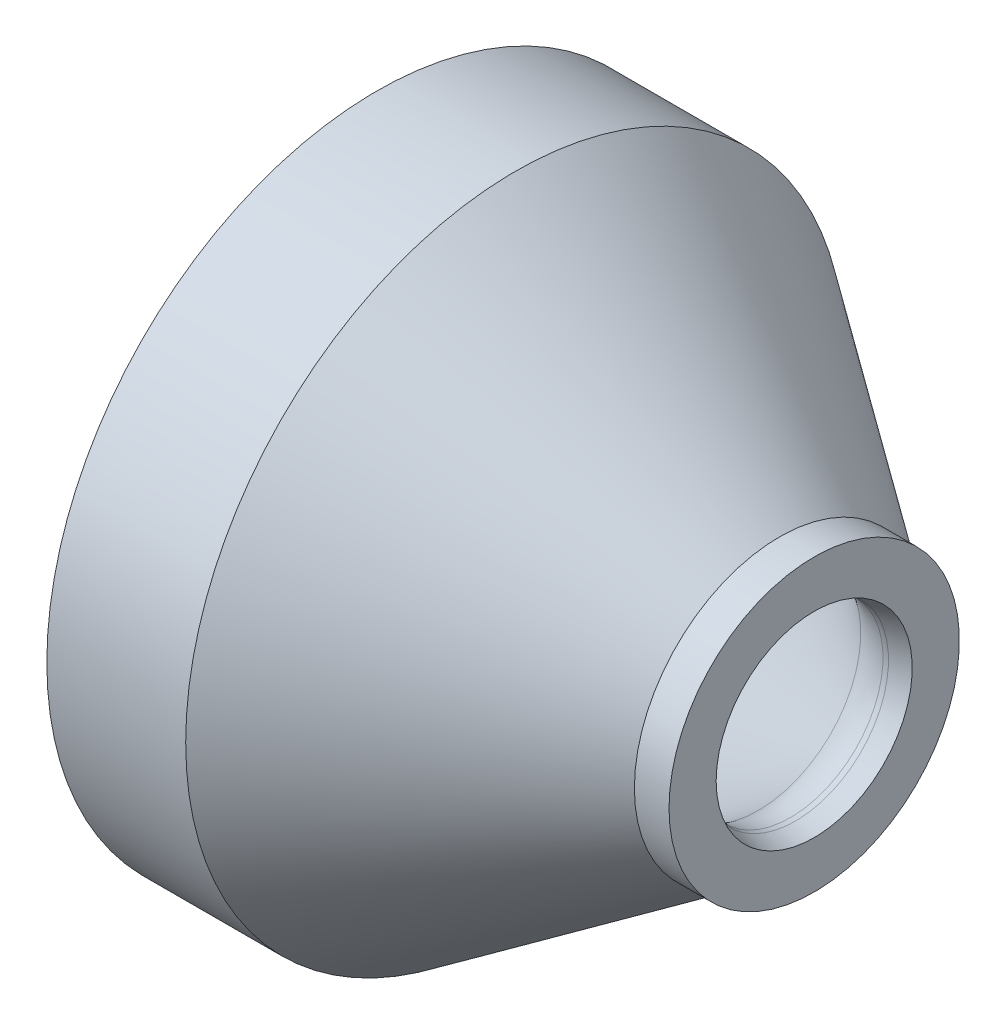
ISO-10303-21;
HEADER;
FILE_DESCRIPTION(('STEP AP214'),'2;1');
FILE_NAME('part.step','',(''),(''),'','','');
FILE_SCHEMA(('AUTOMOTIVE_DESIGN { 1 0 10303 214 1 1 1 1 }'));
ENDSEC;
DATA;
#1=APPLICATION_CONTEXT('core data for automotive mechanical design processes');
#2=APPLICATION_PROTOCOL_DEFINITION('international standard','automotive_design',2000,#1);
#3=PRODUCT_CONTEXT('',#1,'mechanical');
#4=PRODUCT('Part','Part','',(#3));
#5=PRODUCT_RELATED_PRODUCT_CATEGORY('part','',(#4));
#6=PRODUCT_DEFINITION_FORMATION('','',#4);
#7=PRODUCT_DEFINITION_CONTEXT('part definition',#1,'design');
#8=PRODUCT_DEFINITION('design','',#6,#7);
#9=PRODUCT_DEFINITION_SHAPE('','',#8);
#10=(LENGTH_UNIT() NAMED_UNIT(*) SI_UNIT(.MILLI.,.METRE.));
#11=(NAMED_UNIT(*) PLANE_ANGLE_UNIT() SI_UNIT($,.RADIAN.));
#12=(NAMED_UNIT(*) SI_UNIT($,.STERADIAN.) SOLID_ANGLE_UNIT());
#13=UNCERTAINTY_MEASURE_WITH_UNIT(LENGTH_MEASURE(1.E-05),#10,'distance_accuracy_value','');
#14=(GEOMETRIC_REPRESENTATION_CONTEXT(3) GLOBAL_UNCERTAINTY_ASSIGNED_CONTEXT((#13)) GLOBAL_UNIT_ASSIGNED_CONTEXT((#10,
#11,#12)) REPRESENTATION_CONTEXT('',''));
#15=CARTESIAN_POINT('',(0.,0.,0.));
#16=DIRECTION('',(0.,0.,1.));
#17=DIRECTION('',(1.,0.,0.));
#18=AXIS2_PLACEMENT_3D('',#15,#16,#17);
#19=CARTESIAN_POINT('',(54.2559021119693,0.,0.));
#20=DIRECTION('',(-1.,0.,0.));
#21=DIRECTION('',(0.,0.,1.));
#22=AXIS2_PLACEMENT_3D('',#19,#20,#21);
#23=CONICAL_SURFACE('',#22,19.558,0.610865238198016);
#24=CARTESIAN_POINT('',(18.7064419281447,0.,0.));
#25=DIRECTION('',(-1.,0.,0.));
#26=DIRECTION('',(0.,0.,1.));
#27=AXIS2_PLACEMENT_3D('',#24,#25,#26);
#28=CIRCLE('',#27,44.45);
#29=CARTESIAN_POINT('',(18.7064419281447,0.,44.45));
#30=VERTEX_POINT('',#29);
#31=EDGE_CURVE('E10',#30,#30,#28,.T.);
#32=ORIENTED_EDGE('',*,*,#31,.F.);
#33=EDGE_LOOP('',(#32));
#34=FACE_BOUND('',#33,.T.);
#35=CARTESIAN_POINT('',(54.2559021119693,0.,0.));
#36=DIRECTION('',(-1.,0.,0.));
#37=DIRECTION('',(0.,0.,1.));
#38=AXIS2_PLACEMENT_3D('',#35,#36,#37);
#39=CIRCLE('',#38,19.558);
#40=CARTESIAN_POINT('',(54.2559021119693,0.,19.558));
#41=VERTEX_POINT('',#40);
#42=EDGE_CURVE('E71',#41,#41,#39,.T.);
#43=ORIENTED_EDGE('',*,*,#42,.T.);
#44=EDGE_LOOP('',(#43));
#45=FACE_BOUND('',#44,.T.);
#46=ADVANCED_FACE('F31',(#34,#45),#23,.T.);
#47=CARTESIAN_POINT('',(0.,0.,0.));
#48=DIRECTION('',(-1.,0.,0.));
#49=DIRECTION('',(0.,0.,1.));
#50=AXIS2_PLACEMENT_3D('',#47,#48,#49);
#51=CYLINDRICAL_SURFACE('',#50,44.45);
#52=CARTESIAN_POINT('',(0.,0.,0.));
#53=DIRECTION('',(-1.,0.,0.));
#54=DIRECTION('',(0.,0.,1.));
#55=AXIS2_PLACEMENT_3D('',#52,#53,#54);
#56=CIRCLE('',#55,44.45);
#57=CARTESIAN_POINT('',(0.,0.,44.45));
#58=VERTEX_POINT('',#57);
#59=EDGE_CURVE('E37',#58,#58,#56,.T.);
#60=ORIENTED_EDGE('',*,*,#59,.F.);
#61=EDGE_LOOP('',(#60));
#62=FACE_BOUND('',#61,.T.);
#63=ORIENTED_EDGE('',*,*,#31,.T.);
#64=EDGE_LOOP('',(#63));
#65=FACE_BOUND('',#64,.T.);
#66=ADVANCED_FACE('F132',(#62,#65),#51,.T.);
#67=CARTESIAN_POINT('',(0.,44.45,0.));
#68=DIRECTION('',(1.,0.,0.));
#69=DIRECTION('',(0.,0.,-1.));
#70=AXIS2_PLACEMENT_3D('',#67,#68,#69);
#71=PLANE('',#70);
#72=CARTESIAN_POINT('',(0.,0.,0.));
#73=DIRECTION('',(-1.,0.,0.));
#74=DIRECTION('',(0.,0.,1.));
#75=AXIS2_PLACEMENT_3D('',#72,#73,#74);
#76=CIRCLE('',#75,41.275);
#77=CARTESIAN_POINT('',(0.,0.,41.275));
#78=VERTEX_POINT('',#77);
#79=EDGE_CURVE('E41',#78,#78,#76,.T.);
#80=ORIENTED_EDGE('',*,*,#79,.F.);
#81=EDGE_LOOP('',(#80));
#82=FACE_BOUND('',#81,.T.);
#83=ORIENTED_EDGE('',*,*,#59,.T.);
#84=EDGE_LOOP('',(#83));
#85=FACE_BOUND('',#84,.T.);
#86=ADVANCED_FACE('F127',(#82,#85),#71,.F.);
#87=CARTESIAN_POINT('',(0.,0.,0.));
#88=DIRECTION('',(-1.,0.,0.));
#89=DIRECTION('',(0.,0.,1.));
#90=AXIS2_PLACEMENT_3D('',#87,#88,#89);
#91=CYLINDRICAL_SURFACE('',#90,41.275);
#92=CARTESIAN_POINT('',(12.7,0.,0.));
#93=DIRECTION('',(-1.,0.,0.));
#94=DIRECTION('',(0.,0.,1.));
#95=AXIS2_PLACEMENT_3D('',#92,#93,#94);
#96=CIRCLE('',#95,41.275);
#97=CARTESIAN_POINT('',(12.7,0.,41.275));
#98=VERTEX_POINT('',#97);
#99=EDGE_CURVE('E45',#98,#98,#96,.T.);
#100=ORIENTED_EDGE('',*,*,#99,.F.);
#101=EDGE_LOOP('',(#100));
#102=FACE_BOUND('',#101,.T.);
#103=ORIENTED_EDGE('',*,*,#79,.T.);
#104=EDGE_LOOP('',(#103));
#105=FACE_BOUND('',#104,.T.);
#106=ADVANCED_FACE('F121',(#102,#105),#91,.F.);
#107=CARTESIAN_POINT('',(12.7,41.275,0.));
#108=DIRECTION('',(1.,0.,0.));
#109=DIRECTION('',(0.,0.,-1.));
#110=AXIS2_PLACEMENT_3D('',#107,#108,#109);
#111=PLANE('',#110);
#112=CARTESIAN_POINT('',(12.7,0.,0.));
#113=DIRECTION('',(-1.,0.,0.));
#114=DIRECTION('',(0.,0.,1.));
#115=AXIS2_PLACEMENT_3D('',#112,#113,#114);
#116=CIRCLE('',#115,38.1);
#117=CARTESIAN_POINT('',(12.7,0.,38.1));
#118=VERTEX_POINT('',#117);
#119=EDGE_CURVE('E50',#118,#118,#116,.T.);
#120=ORIENTED_EDGE('',*,*,#119,.F.);
#121=EDGE_LOOP('',(#120));
#122=FACE_BOUND('',#121,.T.);
#123=ORIENTED_EDGE('',*,*,#99,.T.);
#124=EDGE_LOOP('',(#123));
#125=FACE_BOUND('',#124,.T.);
#126=ADVANCED_FACE('F115',(#122,#125),#111,.F.);
#127=CARTESIAN_POINT('',(12.7,0.,0.));
#128=DIRECTION('',(-1.,0.,0.));
#129=DIRECTION('',(0.,0.,1.));
#130=AXIS2_PLACEMENT_3D('',#127,#128,#129);
#131=TOROIDAL_SURFACE('',#130,25.4,12.7);
#132=CARTESIAN_POINT('',(19.9844207416583,0.,0.));
#133=DIRECTION('',(-1.,0.,0.));
#134=DIRECTION('',(0.,0.,1.));
#135=AXIS2_PLACEMENT_3D('',#132,#133,#134);
#136=CIRCLE('',#135,35.8032309624702);
#137=CARTESIAN_POINT('',(19.9844207416583,0.,35.8032309624702));
#138=VERTEX_POINT('',#137);
#139=EDGE_CURVE('E53',#138,#138,#136,.T.);
#140=ORIENTED_EDGE('',*,*,#139,.F.);
#141=EDGE_LOOP('',(#140));
#142=FACE_BOUND('',#141,.T.);
#143=ORIENTED_EDGE('',*,*,#119,.T.);
#144=EDGE_LOOP('',(#143));
#145=FACE_BOUND('',#144,.T.);
#146=ADVANCED_FACE('F109',(#142,#145),#131,.F.);
#147=CARTESIAN_POINT('',(19.9844207416583,0.,0.));
#148=DIRECTION('',(-1.,0.,0.));
#149=DIRECTION('',(0.,0.,1.));
#150=AXIS2_PLACEMENT_3D('',#147,#148,#149);
#151=CONICAL_SURFACE('',#150,35.8032309624702,0.610865238198016);
#152=CARTESIAN_POINT('',(51.3739279099881,0.,0.));
#153=DIRECTION('',(-1.,0.,0.));
#154=DIRECTION('',(0.,0.,1.));
#155=AXIS2_PLACEMENT_3D('',#152,#153,#154);
#156=CIRCLE('',#155,13.8240614225179);
#157=CARTESIAN_POINT('',(51.3739279099881,0.,13.8240614225179));
#158=VERTEX_POINT('',#157);
#159=EDGE_CURVE('E56',#158,#158,#156,.T.);
#160=ORIENTED_EDGE('',*,*,#159,.F.);
#161=EDGE_LOOP('',(#160));
#162=FACE_BOUND('',#161,.T.);
#163=ORIENTED_EDGE('',*,*,#139,.T.);
#164=EDGE_LOOP('',(#163));
#165=FACE_BOUND('',#164,.T.);
#166=ADVANCED_FACE('F103',(#162,#165),#151,.F.);
#167=CARTESIAN_POINT('',(55.7445803549831,0.,0.));
#168=DIRECTION('',(-1.,0.,0.));
#169=DIRECTION('',(0.,0.,1.));
#170=AXIS2_PLACEMENT_3D('',#167,#168,#169);
#171=TOROIDAL_SURFACE('',#170,20.066,7.62);
#172=CARTESIAN_POINT('',(55.7445803549831,0.,0.));
#173=DIRECTION('',(-1.,0.,0.));
#174=DIRECTION('',(0.,0.,1.));
#175=AXIS2_PLACEMENT_3D('',#172,#173,#174);
#176=CIRCLE('',#175,12.446);
#177=CARTESIAN_POINT('',(55.7445803549831,0.,12.446));
#178=VERTEX_POINT('',#177);
#179=EDGE_CURVE('E59',#178,#178,#176,.T.);
#180=ORIENTED_EDGE('',*,*,#179,.F.);
#181=EDGE_LOOP('',(#180));
#182=FACE_BOUND('',#181,.T.);
#183=ORIENTED_EDGE('',*,*,#159,.T.);
#184=EDGE_LOOP('',(#183));
#185=FACE_BOUND('',#184,.T.);
#186=ADVANCED_FACE('F97',(#182,#185),#171,.T.);
#187=CARTESIAN_POINT('',(55.7445803549831,0.,0.));
#188=DIRECTION('',(-1.,0.,0.));
#189=DIRECTION('',(0.,0.,1.));
#190=AXIS2_PLACEMENT_3D('',#187,#188,#189);
#191=TOROIDAL_SURFACE('',#190,14.986,2.54);
#192=CARTESIAN_POINT('',(56.4019807295435,0.,0.));
#193=DIRECTION('',(-1.,0.,0.));
#194=DIRECTION('',(0.,0.,1.));
#195=AXIS2_PLACEMENT_3D('',#192,#193,#194);
#196=CIRCLE('',#195,12.5325484012258);
#197=CARTESIAN_POINT('',(56.4019807295435,0.,12.5325484012258));
#198=VERTEX_POINT('',#197);
#199=EDGE_CURVE('E62',#198,#198,#196,.T.);
#200=ORIENTED_EDGE('',*,*,#199,.F.);
#201=EDGE_LOOP('',(#200));
#202=FACE_BOUND('',#201,.T.);
#203=ORIENTED_EDGE('',*,*,#179,.T.);
#204=EDGE_LOOP('',(#203));
#205=FACE_BOUND('',#204,.T.);
#206=ADVANCED_FACE('F91',(#202,#205),#191,.T.);
#207=CARTESIAN_POINT('',(56.4019807295435,0.,0.));
#208=DIRECTION('',(1.,0.,0.));
#209=DIRECTION('',(0.,0.,-1.));
#210=AXIS2_PLACEMENT_3D('',#207,#208,#209);
#211=CONICAL_SURFACE('',#210,12.5325484012258,0.26179938779915);
#212=CARTESIAN_POINT('',(58.9228004142226,0.,0.));
#213=DIRECTION('',(-1.,0.,0.));
#214=DIRECTION('',(0.,0.,1.));
#215=AXIS2_PLACEMENT_3D('',#212,#213,#214);
#216=CIRCLE('',#215,13.208);
#217=CARTESIAN_POINT('',(58.9228004142226,0.,13.208));
#218=VERTEX_POINT('',#217);
#219=EDGE_CURVE('E65',#218,#218,#216,.T.);
#220=ORIENTED_EDGE('',*,*,#219,.F.);
#221=EDGE_LOOP('',(#220));
#222=FACE_BOUND('',#221,.T.);
#223=ORIENTED_EDGE('',*,*,#199,.T.);
#224=EDGE_LOOP('',(#223));
#225=FACE_BOUND('',#224,.T.);
#226=ADVANCED_FACE('F85',(#222,#225),#211,.F.);
#227=CARTESIAN_POINT('',(58.9228004142226,13.208,0.));
#228=DIRECTION('',(-1.,0.,0.));
#229=DIRECTION('',(0.,0.,1.));
#230=AXIS2_PLACEMENT_3D('',#227,#228,#229);
#231=PLANE('',#230);
#232=CARTESIAN_POINT('',(58.9228004142226,0.,0.));
#233=DIRECTION('',(-1.,0.,0.));
#234=DIRECTION('',(0.,0.,1.));
#235=AXIS2_PLACEMENT_3D('',#232,#233,#234);
#236=CIRCLE('',#235,19.558);
#237=CARTESIAN_POINT('',(58.9228004142226,0.,19.558));
#238=VERTEX_POINT('',#237);
#239=EDGE_CURVE('E68',#238,#238,#236,.T.);
#240=ORIENTED_EDGE('',*,*,#239,.F.);
#241=EDGE_LOOP('',(#240));
#242=FACE_BOUND('',#241,.T.);
#243=ORIENTED_EDGE('',*,*,#219,.T.);
#244=EDGE_LOOP('',(#243));
#245=FACE_BOUND('',#244,.T.);
#246=ADVANCED_FACE('F79',(#242,#245),#231,.F.);
#247=CARTESIAN_POINT('',(0.,0.,0.));
#248=DIRECTION('',(-1.,0.,0.));
#249=DIRECTION('',(0.,0.,1.));
#250=AXIS2_PLACEMENT_3D('',#247,#248,#249);
#251=CYLINDRICAL_SURFACE('',#250,19.558);
#252=ORIENTED_EDGE('',*,*,#42,.F.);
#253=EDGE_LOOP('',(#252));
#254=FACE_BOUND('',#253,.T.);
#255=ORIENTED_EDGE('',*,*,#239,.T.);
#256=EDGE_LOOP('',(#255));
#257=FACE_BOUND('',#256,.T.);
#258=ADVANCED_FACE('F76',(#254,#257),#251,.T.);
#259=CLOSED_SHELL('',(#46,#66,#86,#106,#126,#146,#166,#186,#206,#226,#246,#258));
#260=MANIFOLD_SOLID_BREP('B2',#259);
#261=ADVANCED_BREP_SHAPE_REPRESENTATION('',(#18,#260),#14);
#262=SHAPE_DEFINITION_REPRESENTATION(#9,#261);
ENDSEC;
END-ISO-10303-21;
